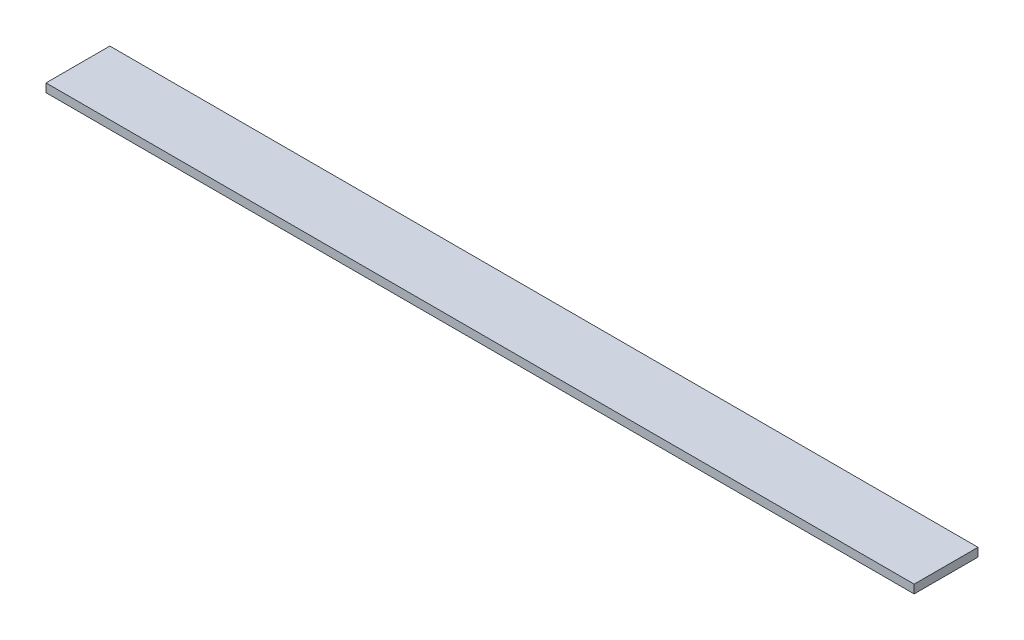
ISO-10303-21;
HEADER;
FILE_DESCRIPTION(('STEP AP214'),'2;1');
FILE_NAME('part.step','',(''),(''),'','','');
FILE_SCHEMA(('AUTOMOTIVE_DESIGN { 1 0 10303 214 1 1 1 1 }'));
ENDSEC;
DATA;
#1=APPLICATION_CONTEXT('core data for automotive mechanical design processes');
#2=APPLICATION_PROTOCOL_DEFINITION('international standard','automotive_design',2000,#1);
#3=PRODUCT_CONTEXT('',#1,'mechanical');
#4=PRODUCT('Part','Part','',(#3));
#5=PRODUCT_RELATED_PRODUCT_CATEGORY('part','',(#4));
#6=PRODUCT_DEFINITION_FORMATION('','',#4);
#7=PRODUCT_DEFINITION_CONTEXT('part definition',#1,'design');
#8=PRODUCT_DEFINITION('design','',#6,#7);
#9=PRODUCT_DEFINITION_SHAPE('','',#8);
#10=(LENGTH_UNIT() NAMED_UNIT(*) SI_UNIT(.MILLI.,.METRE.));
#11=(NAMED_UNIT(*) PLANE_ANGLE_UNIT() SI_UNIT($,.RADIAN.));
#12=(NAMED_UNIT(*) SI_UNIT($,.STERADIAN.) SOLID_ANGLE_UNIT());
#13=UNCERTAINTY_MEASURE_WITH_UNIT(LENGTH_MEASURE(1.E-05),#10,'distance_accuracy_value','');
#14=(GEOMETRIC_REPRESENTATION_CONTEXT(3) GLOBAL_UNCERTAINTY_ASSIGNED_CONTEXT((#13)) GLOBAL_UNIT_ASSIGNED_CONTEXT((#10,
#11,#12)) REPRESENTATION_CONTEXT('',''));
#15=CARTESIAN_POINT('',(0.,0.,0.));
#16=DIRECTION('',(0.,0.,1.));
#17=DIRECTION('',(1.,0.,0.));
#18=AXIS2_PLACEMENT_3D('',#15,#16,#17);
#19=CARTESIAN_POINT('',(408.,-2.,-15.));
#20=DIRECTION('',(0.,0.,1.));
#21=DIRECTION('',(1.,0.,0.));
#22=AXIS2_PLACEMENT_3D('',#19,#20,#21);
#23=PLANE('',#22);
#24=DIRECTION('',(0.,1.,0.));
#25=VECTOR('',#24,1.);
#26=CARTESIAN_POINT('',(0.,-2.,-15.));
#27=LINE('',#26,#25);
#28=CARTESIAN_POINT('',(0.,-2.,-15.));
#29=VERTEX_POINT('',#28);
#30=CARTESIAN_POINT('',(0.,2.,-15.));
#31=VERTEX_POINT('',#30);
#32=EDGE_CURVE('E98',#29,#31,#27,.T.);
#33=ORIENTED_EDGE('',*,*,#32,.T.);
#34=DIRECTION('',(-1.,0.,0.));
#35=VECTOR('',#34,1.);
#36=CARTESIAN_POINT('',(408.,2.,-15.));
#37=LINE('',#36,#35);
#38=CARTESIAN_POINT('',(408.,2.,-15.));
#39=VERTEX_POINT('',#38);
#40=EDGE_CURVE('E11',#39,#31,#37,.T.);
#41=ORIENTED_EDGE('',*,*,#40,.F.);
#42=DIRECTION('',(0.,1.,0.));
#43=VECTOR('',#42,1.);
#44=CARTESIAN_POINT('',(408.,-2.,-15.));
#45=LINE('',#44,#43);
#46=CARTESIAN_POINT('',(408.,-2.,-15.));
#47=VERTEX_POINT('',#46);
#48=EDGE_CURVE('E86',#47,#39,#45,.T.);
#49=ORIENTED_EDGE('',*,*,#48,.F.);
#50=DIRECTION('',(-1.,0.,0.));
#51=VECTOR('',#50,1.);
#52=CARTESIAN_POINT('',(408.,-2.,-15.));
#53=LINE('',#52,#51);
#54=EDGE_CURVE('E94',#47,#29,#53,.T.);
#55=ORIENTED_EDGE('',*,*,#54,.T.);
#56=EDGE_LOOP('',(#33,#41,#49,#55));
#57=FACE_BOUND('',#56,.T.);
#58=ADVANCED_FACE('F35',(#57),#23,.F.);
#59=CARTESIAN_POINT('',(408.,2.,15.));
#60=DIRECTION('',(0.,-1.,0.));
#61=DIRECTION('',(0.,0.,-1.));
#62=AXIS2_PLACEMENT_3D('',#59,#60,#61);
#63=PLANE('',#62);
#64=DIRECTION('',(0.,0.,1.));
#65=VECTOR('',#64,1.);
#66=CARTESIAN_POINT('',(0.,2.,15.));
#67=LINE('',#66,#65);
#68=CARTESIAN_POINT('',(0.,2.,15.));
#69=VERTEX_POINT('',#68);
#70=EDGE_CURVE('E90',#31,#69,#67,.T.);
#71=ORIENTED_EDGE('',*,*,#70,.T.);
#72=DIRECTION('',(-1.,0.,0.));
#73=VECTOR('',#72,1.);
#74=CARTESIAN_POINT('',(408.,2.,15.));
#75=LINE('',#74,#73);
#76=CARTESIAN_POINT('',(408.,2.,15.));
#77=VERTEX_POINT('',#76);
#78=EDGE_CURVE('E43',#77,#69,#75,.T.);
#79=ORIENTED_EDGE('',*,*,#78,.F.);
#80=DIRECTION('',(0.,0.,1.));
#81=VECTOR('',#80,1.);
#82=CARTESIAN_POINT('',(408.,2.,15.));
#83=LINE('',#82,#81);
#84=EDGE_CURVE('E81',#39,#77,#83,.T.);
#85=ORIENTED_EDGE('',*,*,#84,.F.);
#86=ORIENTED_EDGE('',*,*,#40,.T.);
#87=EDGE_LOOP('',(#71,#79,#85,#86));
#88=FACE_BOUND('',#87,.T.);
#89=ADVANCED_FACE('F89',(#88),#63,.F.);
#90=CARTESIAN_POINT('',(408.,-2.,15.));
#91=DIRECTION('',(0.,0.,-1.));
#92=DIRECTION('',(-1.,0.,0.));
#93=AXIS2_PLACEMENT_3D('',#90,#91,#92);
#94=PLANE('',#93);
#95=DIRECTION('',(0.,-1.,0.));
#96=VECTOR('',#95,1.);
#97=CARTESIAN_POINT('',(0.,-2.,15.));
#98=LINE('',#97,#96);
#99=CARTESIAN_POINT('',(0.,-2.,15.));
#100=VERTEX_POINT('',#99);
#101=EDGE_CURVE('E68',#69,#100,#98,.T.);
#102=ORIENTED_EDGE('',*,*,#101,.T.);
#103=DIRECTION('',(-1.,0.,0.));
#104=VECTOR('',#103,1.);
#105=CARTESIAN_POINT('',(408.,-2.,15.));
#106=LINE('',#105,#104);
#107=CARTESIAN_POINT('',(408.,-2.,15.));
#108=VERTEX_POINT('',#107);
#109=EDGE_CURVE('E91',#108,#100,#106,.T.);
#110=ORIENTED_EDGE('',*,*,#109,.F.);
#111=DIRECTION('',(0.,-1.,0.));
#112=VECTOR('',#111,1.);
#113=CARTESIAN_POINT('',(408.,-2.,15.));
#114=LINE('',#113,#112);
#115=EDGE_CURVE('E84',#77,#108,#114,.T.);
#116=ORIENTED_EDGE('',*,*,#115,.F.);
#117=ORIENTED_EDGE('',*,*,#78,.T.);
#118=EDGE_LOOP('',(#102,#110,#116,#117));
#119=FACE_BOUND('',#118,.T.);
#120=ADVANCED_FACE('F92',(#119),#94,.F.);
#121=CARTESIAN_POINT('',(408.,-2.,15.));
#122=DIRECTION('',(0.,1.,0.));
#123=DIRECTION('',(0.,0.,1.));
#124=AXIS2_PLACEMENT_3D('',#121,#122,#123);
#125=PLANE('',#124);
#126=DIRECTION('',(0.,0.,-1.));
#127=VECTOR('',#126,1.);
#128=CARTESIAN_POINT('',(0.,-2.,15.));
#129=LINE('',#128,#127);
#130=EDGE_CURVE('E74',#100,#29,#129,.T.);
#131=ORIENTED_EDGE('',*,*,#130,.T.);
#132=ORIENTED_EDGE('',*,*,#54,.F.);
#133=DIRECTION('',(0.,0.,-1.));
#134=VECTOR('',#133,1.);
#135=CARTESIAN_POINT('',(408.,-2.,15.));
#136=LINE('',#135,#134);
#137=EDGE_CURVE('E51',#108,#47,#136,.T.);
#138=ORIENTED_EDGE('',*,*,#137,.F.);
#139=ORIENTED_EDGE('',*,*,#109,.T.);
#140=EDGE_LOOP('',(#131,#132,#138,#139));
#141=FACE_BOUND('',#140,.T.);
#142=ADVANCED_FACE('F105',(#141),#125,.F.);
#143=CARTESIAN_POINT('',(408.,0.,0.));
#144=DIRECTION('',(-1.,0.,0.));
#145=DIRECTION('',(0.,0.,1.));
#146=AXIS2_PLACEMENT_3D('',#143,#144,#145);
#147=PLANE('',#146);
#148=ORIENTED_EDGE('',*,*,#48,.T.);
#149=ORIENTED_EDGE('',*,*,#84,.T.);
#150=ORIENTED_EDGE('',*,*,#115,.T.);
#151=ORIENTED_EDGE('',*,*,#137,.T.);
#152=EDGE_LOOP('',(#148,#149,#150,#151));
#153=FACE_BOUND('',#152,.T.);
#154=ADVANCED_FACE('F82',(#153),#147,.F.);
#155=CARTESIAN_POINT('',(0.,0.,0.));
#156=DIRECTION('',(-1.,0.,0.));
#157=DIRECTION('',(0.,0.,1.));
#158=AXIS2_PLACEMENT_3D('',#155,#156,#157);
#159=PLANE('',#158);
#160=ORIENTED_EDGE('',*,*,#32,.F.);
#161=ORIENTED_EDGE('',*,*,#130,.F.);
#162=ORIENTED_EDGE('',*,*,#101,.F.);
#163=ORIENTED_EDGE('',*,*,#70,.F.);
#164=EDGE_LOOP('',(#160,#161,#162,#163));
#165=FACE_BOUND('',#164,.T.);
#166=ADVANCED_FACE('F108',(#165),#159,.T.);
#167=CLOSED_SHELL('',(#58,#89,#120,#142,#154,#166));
#168=MANIFOLD_SOLID_BREP('B2',#167);
#169=ADVANCED_BREP_SHAPE_REPRESENTATION('',(#18,#168),#14);
#170=SHAPE_DEFINITION_REPRESENTATION(#9,#169);
ENDSEC;
END-ISO-10303-21;
